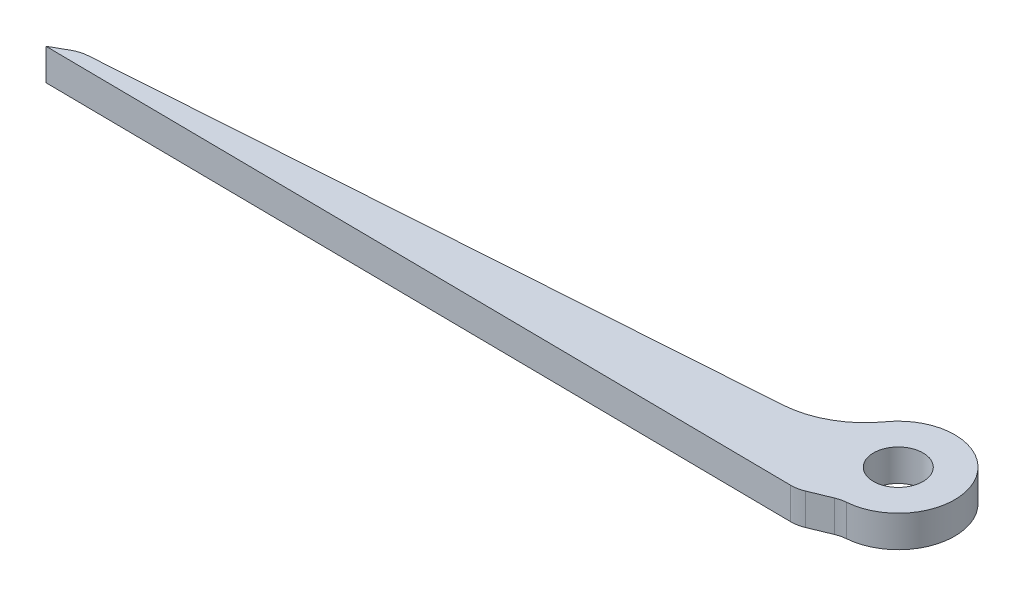
ISO-10303-21;
HEADER;
FILE_DESCRIPTION(('STEP AP214'),'2;1');
FILE_NAME('part.step','',(''),(''),'','','');
FILE_SCHEMA(('AUTOMOTIVE_DESIGN { 1 0 10303 214 1 1 1 1 }'));
ENDSEC;
DATA;
#1=APPLICATION_CONTEXT('core data for automotive mechanical design processes');
#2=APPLICATION_PROTOCOL_DEFINITION('international standard','automotive_design',2000,#1);
#3=PRODUCT_CONTEXT('',#1,'mechanical');
#4=PRODUCT('Part','Part','',(#3));
#5=PRODUCT_RELATED_PRODUCT_CATEGORY('part','',(#4));
#6=PRODUCT_DEFINITION_FORMATION('','',#4);
#7=PRODUCT_DEFINITION_CONTEXT('part definition',#1,'design');
#8=PRODUCT_DEFINITION('design','',#6,#7);
#9=PRODUCT_DEFINITION_SHAPE('','',#8);
#10=(LENGTH_UNIT() NAMED_UNIT(*) SI_UNIT(.MILLI.,.METRE.));
#11=(NAMED_UNIT(*) PLANE_ANGLE_UNIT() SI_UNIT($,.RADIAN.));
#12=(NAMED_UNIT(*) SI_UNIT($,.STERADIAN.) SOLID_ANGLE_UNIT());
#13=UNCERTAINTY_MEASURE_WITH_UNIT(LENGTH_MEASURE(1.E-05),#10,'distance_accuracy_value','');
#14=(GEOMETRIC_REPRESENTATION_CONTEXT(3) GLOBAL_UNCERTAINTY_ASSIGNED_CONTEXT((#13)) GLOBAL_UNIT_ASSIGNED_CONTEXT((#10,
#11,#12)) REPRESENTATION_CONTEXT('',''));
#15=CARTESIAN_POINT('',(0.,0.,0.));
#16=DIRECTION('',(0.,0.,1.));
#17=DIRECTION('',(1.,0.,0.));
#18=AXIS2_PLACEMENT_3D('',#15,#16,#17);
#19=CARTESIAN_POINT('',(0.,3.175,0.));
#20=DIRECTION('',(0.,1.,0.));
#21=DIRECTION('',(0.,0.,1.));
#22=AXIS2_PLACEMENT_3D('',#19,#20,#21);
#23=PLANE('',#22);
#24=CARTESIAN_POINT('',(0.,3.175,0.));
#25=DIRECTION('',(0.,1.,0.));
#26=DIRECTION('',(0.,0.,1.));
#27=AXIS2_PLACEMENT_3D('',#24,#25,#26);
#28=CIRCLE('',#27,5.6642);
#29=CARTESIAN_POINT('',(0.444946616900004,3.175,5.64669674660409));
#30=VERTEX_POINT('',#29);
#31=CARTESIAN_POINT('',(-4.60174845221113,3.175,-3.30258577823082));
#32=VERTEX_POINT('',#31);
#33=EDGE_CURVE('E149',#30,#32,#28,.T.);
#34=ORIENTED_EDGE('',*,*,#33,.T.);
#35=CARTESIAN_POINT('',(-11.8242236014214,3.175,-8.48601637186662));
#36=DIRECTION('',(0.,1.,0.));
#37=DIRECTION('',(0.,0.,1.));
#38=AXIS2_PLACEMENT_3D('',#35,#36,#37);
#39=CIRCLE('',#38,8.89);
#40=CARTESIAN_POINT('',(-11.2121421211736,3.175,0.382887521035677));
#41=VERTEX_POINT('',#40);
#42=EDGE_CURVE('E11',#32,#41,#39,.F.);
#43=ORIENTED_EDGE('',*,*,#42,.T.);
#44=DIRECTION('',(-0.997626984578437,0.,0.0688505602078505));
#45=VECTOR('',#44,1.);
#46=CARTESIAN_POINT('',(-5.6642,3.175,0.));
#47=LINE('',#46,#45);
#48=CARTESIAN_POINT('',(-76.4638174473622,3.175,4.8861883239979));
#49=VERTEX_POINT('',#48);
#50=EDGE_CURVE('E118',#41,#49,#47,.T.);
#51=ORIENTED_EDGE('',*,*,#50,.T.);
#52=CARTESIAN_POINT('',(-76.2452169187023,3.175,8.05365400003444));
#53=DIRECTION('',(0.,1.,0.));
#54=DIRECTION('',(0.,0.,1.));
#55=AXIS2_PLACEMENT_3D('',#52,#53,#54);
#56=CIRCLE('',#55,3.175);
#57=CARTESIAN_POINT('',(-77.8039136184842,3.175,5.28759369734959));
#58=VERTEX_POINT('',#57);
#59=EDGE_CURVE('E114',#49,#58,#56,.T.);
#60=ORIENTED_EDGE('',*,*,#59,.T.);
#61=DIRECTION('',(-0.871200095333811,0.,0.490928094419497));
#62=VECTOR('',#61,1.);
#63=CARTESIAN_POINT('',(-77.1791945502583,3.175,4.93555959708459));
#64=LINE('',#63,#62);
#65=CARTESIAN_POINT('',(-79.3920427924062,3.175,6.18251695691011));
#66=VERTEX_POINT('',#65);
#67=EDGE_CURVE('E107',#58,#66,#64,.T.);
#68=ORIENTED_EDGE('',*,*,#67,.T.);
#69=DIRECTION('',(0.999945461548254,0.,0.0104438464681303));
#70=VECTOR('',#69,1.);
#71=CARTESIAN_POINT('',(-79.3920427924062,3.175,6.18251695691011));
#72=LINE('',#71,#70);
#73=CARTESIAN_POINT('',(-3.83726556900571,3.175,6.97164248784978));
#74=VERTEX_POINT('',#73);
#75=EDGE_CURVE('E111',#66,#74,#72,.T.);
#76=ORIENTED_EDGE('',*,*,#75,.T.);
#77=CARTESIAN_POINT('',(-3.80410635646939,3.175,3.79681564743408));
#78=DIRECTION('',(0.,1.,0.));
#79=DIRECTION('',(0.,0.,1.));
#80=AXIS2_PLACEMENT_3D('',#77,#78,#79);
#81=CIRCLE('',#80,3.175);
#82=CARTESIAN_POINT('',(-2.59537443766945,3.175,6.73272984040263));
#83=VERTEX_POINT('',#82);
#84=EDGE_CURVE('E160',#74,#83,#81,.T.);
#85=ORIENTED_EDGE('',*,*,#84,.T.);
#86=DIRECTION('',(0.924697383612144,0.,-0.380702966551163));
#87=VECTOR('',#86,1.);
#88=CARTESIAN_POINT('',(-3.19204279240622,3.175,6.9783814629996));
#89=LINE('',#88,#87);
#90=CARTESIAN_POINT('',(-0.514375763278859,3.175,5.87597131294276));
#91=VERTEX_POINT('',#90);
#92=EDGE_CURVE('E129',#83,#91,#89,.T.);
#93=ORIENTED_EDGE('',*,*,#92,.T.);
#94=CARTESIAN_POINT('',(0.694356155521082,3.175,8.81188550591132));
#95=DIRECTION('',(0.,1.,0.));
#96=DIRECTION('',(0.,0.,1.));
#97=AXIS2_PLACEMENT_3D('',#94,#95,#96);
#98=CIRCLE('',#97,3.175);
#99=EDGE_CURVE('E174',#91,#30,#98,.F.);
#100=ORIENTED_EDGE('',*,*,#99,.T.);
#101=EDGE_LOOP('',(#34,#43,#51,#60,#68,#76,#85,#93,#100));
#102=FACE_BOUND('',#101,.T.);
#103=CARTESIAN_POINT('',(0.,3.175,0.));
#104=DIRECTION('',(0.,1.,0.));
#105=DIRECTION('',(0.,0.,1.));
#106=AXIS2_PLACEMENT_3D('',#103,#104,#105);
#107=CIRCLE('',#106,2.4892);
#108=CARTESIAN_POINT('',(0.,3.175,2.4892));
#109=VERTEX_POINT('',#108);
#110=EDGE_CURVE('E142',#109,#109,#107,.T.);
#111=ORIENTED_EDGE('',*,*,#110,.F.);
#112=EDGE_LOOP('',(#111));
#113=FACE_BOUND('',#112,.T.);
#114=ADVANCED_FACE('F36',(#102,#113),#23,.T.);
#115=CARTESIAN_POINT('',(0.,0.,0.));
#116=DIRECTION('',(0.,1.,0.));
#117=DIRECTION('',(0.,0.,1.));
#118=AXIS2_PLACEMENT_3D('',#115,#116,#117);
#119=PLANE('',#118);
#120=DIRECTION('',(-0.871200095333811,0.,0.490928094419497));
#121=VECTOR('',#120,1.);
#122=CARTESIAN_POINT('',(-77.1791945502583,0.,4.93555959708459));
#123=LINE('',#122,#121);
#124=CARTESIAN_POINT('',(-77.8039136184842,0.,5.28759369734959));
#125=VERTEX_POINT('',#124);
#126=CARTESIAN_POINT('',(-79.3920427924062,0.,6.18251695691011));
#127=VERTEX_POINT('',#126);
#128=EDGE_CURVE('E124',#125,#127,#123,.T.);
#129=ORIENTED_EDGE('',*,*,#128,.F.);
#130=CARTESIAN_POINT('',(-76.2452169187023,0.,8.05365400003444));
#131=DIRECTION('',(0.,1.,0.));
#132=DIRECTION('',(0.,0.,1.));
#133=AXIS2_PLACEMENT_3D('',#130,#131,#132);
#134=CIRCLE('',#133,3.175);
#135=CARTESIAN_POINT('',(-76.4638174473622,0.,4.8861883239979));
#136=VERTEX_POINT('',#135);
#137=EDGE_CURVE('E154',#125,#136,#134,.F.);
#138=ORIENTED_EDGE('',*,*,#137,.T.);
#139=DIRECTION('',(-0.997626984578437,0.,0.0688505602078505));
#140=VECTOR('',#139,1.);
#141=CARTESIAN_POINT('',(-5.6642,0.,0.));
#142=LINE('',#141,#140);
#143=CARTESIAN_POINT('',(-11.2121421211736,0.,0.382887521035677));
#144=VERTEX_POINT('',#143);
#145=EDGE_CURVE('E141',#144,#136,#142,.T.);
#146=ORIENTED_EDGE('',*,*,#145,.F.);
#147=CARTESIAN_POINT('',(-11.8242236014214,0.,-8.48601637186662));
#148=DIRECTION('',(0.,1.,0.));
#149=DIRECTION('',(0.,0.,1.));
#150=AXIS2_PLACEMENT_3D('',#147,#148,#149);
#151=CIRCLE('',#150,8.89);
#152=CARTESIAN_POINT('',(-4.60174845221113,0.,-3.30258577823082));
#153=VERTEX_POINT('',#152);
#154=EDGE_CURVE('E44',#144,#153,#151,.T.);
#155=ORIENTED_EDGE('',*,*,#154,.T.);
#156=CARTESIAN_POINT('',(0.,0.,0.));
#157=DIRECTION('',(0.,1.,0.));
#158=DIRECTION('',(0.,0.,1.));
#159=AXIS2_PLACEMENT_3D('',#156,#157,#158);
#160=CIRCLE('',#159,5.6642);
#161=CARTESIAN_POINT('',(0.444946616900004,0.,5.64669674660409));
#162=VERTEX_POINT('',#161);
#163=EDGE_CURVE('E139',#162,#153,#160,.T.);
#164=ORIENTED_EDGE('',*,*,#163,.F.);
#165=CARTESIAN_POINT('',(0.694356155521082,0.,8.81188550591132));
#166=DIRECTION('',(0.,1.,0.));
#167=DIRECTION('',(0.,0.,1.));
#168=AXIS2_PLACEMENT_3D('',#165,#166,#167);
#169=CIRCLE('',#168,3.175);
#170=CARTESIAN_POINT('',(-0.514375763278859,0.,5.87597131294276));
#171=VERTEX_POINT('',#170);
#172=EDGE_CURVE('E172',#162,#171,#169,.T.);
#173=ORIENTED_EDGE('',*,*,#172,.T.);
#174=DIRECTION('',(0.924697383612144,0.,-0.380702966551163));
#175=VECTOR('',#174,1.);
#176=CARTESIAN_POINT('',(-3.19204279240622,0.,6.9783814629996));
#177=LINE('',#176,#175);
#178=CARTESIAN_POINT('',(-2.59537443766945,0.,6.73272984040263));
#179=VERTEX_POINT('',#178);
#180=EDGE_CURVE('E147',#179,#171,#177,.T.);
#181=ORIENTED_EDGE('',*,*,#180,.F.);
#182=CARTESIAN_POINT('',(-3.80410635646939,0.,3.79681564743408));
#183=DIRECTION('',(0.,1.,0.));
#184=DIRECTION('',(0.,0.,1.));
#185=AXIS2_PLACEMENT_3D('',#182,#183,#184);
#186=CIRCLE('',#185,3.175);
#187=CARTESIAN_POINT('',(-3.83726556900571,0.,6.97164248784978));
#188=VERTEX_POINT('',#187);
#189=EDGE_CURVE('E152',#179,#188,#186,.F.);
#190=ORIENTED_EDGE('',*,*,#189,.T.);
#191=DIRECTION('',(0.999945461548254,0.,0.0104438464681303));
#192=VECTOR('',#191,1.);
#193=CARTESIAN_POINT('',(-79.3920427924062,0.,6.18251695691011));
#194=LINE('',#193,#192);
#195=EDGE_CURVE('E145',#127,#188,#194,.T.);
#196=ORIENTED_EDGE('',*,*,#195,.F.);
#197=EDGE_LOOP('',(#129,#138,#146,#155,#164,#173,#181,#190,#196));
#198=FACE_BOUND('',#197,.T.);
#199=CARTESIAN_POINT('',(0.,0.,0.));
#200=DIRECTION('',(0.,1.,0.));
#201=DIRECTION('',(0.,0.,1.));
#202=AXIS2_PLACEMENT_3D('',#199,#200,#201);
#203=CIRCLE('',#202,2.4892);
#204=CARTESIAN_POINT('',(0.,0.,2.4892));
#205=VERTEX_POINT('',#204);
#206=EDGE_CURVE('E228',#205,#205,#203,.T.);
#207=ORIENTED_EDGE('',*,*,#206,.T.);
#208=EDGE_LOOP('',(#207));
#209=FACE_BOUND('',#208,.T.);
#210=ADVANCED_FACE('F185',(#198,#209),#119,.F.);
#211=CARTESIAN_POINT('',(0.,3.175,0.));
#212=DIRECTION('',(0.,-1.,0.));
#213=DIRECTION('',(0.,0.,-1.));
#214=AXIS2_PLACEMENT_3D('',#211,#212,#213);
#215=CYLINDRICAL_SURFACE('',#214,5.6642);
#216=ORIENTED_EDGE('',*,*,#163,.T.);
#217=DIRECTION('',(0.,-1.,0.));
#218=VECTOR('',#217,1.);
#219=CARTESIAN_POINT('',(-4.60174845221113,3.175,-3.30258577823082));
#220=LINE('',#219,#218);
#221=EDGE_CURVE('E57',#153,#32,#220,.F.);
#222=ORIENTED_EDGE('',*,*,#221,.T.);
#223=ORIENTED_EDGE('',*,*,#33,.F.);
#224=DIRECTION('',(0.,-1.,0.));
#225=VECTOR('',#224,1.);
#226=CARTESIAN_POINT('',(0.444946616900004,3.175,5.64669674660409));
#227=LINE('',#226,#225);
#228=EDGE_CURVE('E169',#30,#162,#227,.T.);
#229=ORIENTED_EDGE('',*,*,#228,.T.);
#230=EDGE_LOOP('',(#216,#222,#223,#229));
#231=FACE_BOUND('',#230,.T.);
#232=ADVANCED_FACE('F210',(#231),#215,.T.);
#233=CARTESIAN_POINT('',(-5.6642,3.175,0.));
#234=DIRECTION('',(0.0688505602078505,0.,0.997626984578437));
#235=DIRECTION('',(0.997626984578437,0.,-0.0688505602078505));
#236=AXIS2_PLACEMENT_3D('',#233,#234,#235);
#237=PLANE('',#236);
#238=ORIENTED_EDGE('',*,*,#50,.F.);
#239=DIRECTION('',(0.,1.,0.));
#240=VECTOR('',#239,1.);
#241=CARTESIAN_POINT('',(-11.2121421211736,0.,0.382887521035675));
#242=LINE('',#241,#240);
#243=EDGE_CURVE('E176',#41,#144,#242,.F.);
#244=ORIENTED_EDGE('',*,*,#243,.T.);
#245=ORIENTED_EDGE('',*,*,#145,.T.);
#246=DIRECTION('',(0.,-1.,0.));
#247=VECTOR('',#246,1.);
#248=CARTESIAN_POINT('',(-76.4638174473622,3.175,4.8861883239979));
#249=LINE('',#248,#247);
#250=EDGE_CURVE('E157',#136,#49,#249,.F.);
#251=ORIENTED_EDGE('',*,*,#250,.T.);
#252=EDGE_LOOP('',(#238,#244,#245,#251));
#253=FACE_BOUND('',#252,.T.);
#254=ADVANCED_FACE('F182',(#253),#237,.F.);
#255=CARTESIAN_POINT('',(-77.1791945502583,3.175,4.93555959708459));
#256=DIRECTION('',(0.490928094419497,0.,0.871200095333811));
#257=DIRECTION('',(0.871200095333811,0.,-0.490928094419497));
#258=AXIS2_PLACEMENT_3D('',#255,#256,#257);
#259=PLANE('',#258);
#260=ORIENTED_EDGE('',*,*,#67,.F.);
#261=DIRECTION('',(0.,-1.,0.));
#262=VECTOR('',#261,1.);
#263=CARTESIAN_POINT('',(-77.8039136184842,3.175,5.28759369734959));
#264=LINE('',#263,#262);
#265=EDGE_CURVE('E128',#58,#125,#264,.T.);
#266=ORIENTED_EDGE('',*,*,#265,.T.);
#267=ORIENTED_EDGE('',*,*,#128,.T.);
#268=DIRECTION('',(0.,-1.,0.));
#269=VECTOR('',#268,1.);
#270=CARTESIAN_POINT('',(-79.3920427924062,3.175,6.18251695691011));
#271=LINE('',#270,#269);
#272=EDGE_CURVE('E121',#66,#127,#271,.T.);
#273=ORIENTED_EDGE('',*,*,#272,.F.);
#274=EDGE_LOOP('',(#260,#266,#267,#273));
#275=FACE_BOUND('',#274,.T.);
#276=ADVANCED_FACE('F122',(#275),#259,.F.);
#277=CARTESIAN_POINT('',(-79.3920427924062,3.175,6.18251695691011));
#278=DIRECTION('',(0.0104438464681303,0.,-0.999945461548254));
#279=DIRECTION('',(-0.999945461548254,0.,-0.0104438464681303));
#280=AXIS2_PLACEMENT_3D('',#277,#278,#279);
#281=PLANE('',#280);
#282=ORIENTED_EDGE('',*,*,#195,.T.);
#283=DIRECTION('',(0.,-1.,0.));
#284=VECTOR('',#283,1.);
#285=CARTESIAN_POINT('',(-3.83726556900571,3.175,6.97164248784978));
#286=LINE('',#285,#284);
#287=EDGE_CURVE('E133',#188,#74,#286,.F.);
#288=ORIENTED_EDGE('',*,*,#287,.T.);
#289=ORIENTED_EDGE('',*,*,#75,.F.);
#290=ORIENTED_EDGE('',*,*,#272,.T.);
#291=EDGE_LOOP('',(#282,#288,#289,#290));
#292=FACE_BOUND('',#291,.T.);
#293=ADVANCED_FACE('F131',(#292),#281,.F.);
#294=CARTESIAN_POINT('',(-3.19204279240622,3.175,6.9783814629996));
#295=DIRECTION('',(-0.380702966551163,0.,-0.924697383612144));
#296=DIRECTION('',(-0.924697383612144,0.,0.380702966551163));
#297=AXIS2_PLACEMENT_3D('',#294,#295,#296);
#298=PLANE('',#297);
#299=ORIENTED_EDGE('',*,*,#92,.F.);
#300=DIRECTION('',(0.,-1.,0.));
#301=VECTOR('',#300,1.);
#302=CARTESIAN_POINT('',(-2.59537443766945,3.175,6.73272984040263));
#303=LINE('',#302,#301);
#304=EDGE_CURVE('E165',#83,#179,#303,.T.);
#305=ORIENTED_EDGE('',*,*,#304,.T.);
#306=ORIENTED_EDGE('',*,*,#180,.T.);
#307=DIRECTION('',(0.,1.,0.));
#308=VECTOR('',#307,1.);
#309=CARTESIAN_POINT('',(-0.514375763278859,3.175,5.87597131294276));
#310=LINE('',#309,#308);
#311=EDGE_CURVE('E163',#171,#91,#310,.T.);
#312=ORIENTED_EDGE('',*,*,#311,.T.);
#313=EDGE_LOOP('',(#299,#305,#306,#312));
#314=FACE_BOUND('',#313,.T.);
#315=ADVANCED_FACE('F201',(#314),#298,.F.);
#316=CARTESIAN_POINT('',(0.,3.175,0.));
#317=DIRECTION('',(0.,-1.,0.));
#318=DIRECTION('',(0.,0.,-1.));
#319=AXIS2_PLACEMENT_3D('',#316,#317,#318);
#320=CYLINDRICAL_SURFACE('',#319,2.4892);
#321=ORIENTED_EDGE('',*,*,#110,.T.);
#322=EDGE_LOOP('',(#321));
#323=FACE_BOUND('',#322,.T.);
#324=ORIENTED_EDGE('',*,*,#206,.F.);
#325=EDGE_LOOP('',(#324));
#326=FACE_BOUND('',#325,.T.);
#327=ADVANCED_FACE('F192',(#323,#326),#320,.F.);
#328=CARTESIAN_POINT('',(-76.2452169187023,3.175,8.05365400003444));
#329=DIRECTION('',(0.,-1.,0.));
#330=DIRECTION('',(0.,0.,-1.));
#331=AXIS2_PLACEMENT_3D('',#328,#329,#330);
#332=CYLINDRICAL_SURFACE('',#331,3.175);
#333=ORIENTED_EDGE('',*,*,#59,.F.);
#334=ORIENTED_EDGE('',*,*,#250,.F.);
#335=ORIENTED_EDGE('',*,*,#137,.F.);
#336=ORIENTED_EDGE('',*,*,#265,.F.);
#337=EDGE_LOOP('',(#333,#334,#335,#336));
#338=FACE_BOUND('',#337,.T.);
#339=ADVANCED_FACE('F189',(#338),#332,.T.);
#340=CARTESIAN_POINT('',(-3.80410635646939,3.175,3.79681564743408));
#341=DIRECTION('',(0.,-1.,0.));
#342=DIRECTION('',(0.,0.,-1.));
#343=AXIS2_PLACEMENT_3D('',#340,#341,#342);
#344=CYLINDRICAL_SURFACE('',#343,3.175);
#345=ORIENTED_EDGE('',*,*,#84,.F.);
#346=ORIENTED_EDGE('',*,*,#287,.F.);
#347=ORIENTED_EDGE('',*,*,#189,.F.);
#348=ORIENTED_EDGE('',*,*,#304,.F.);
#349=EDGE_LOOP('',(#345,#346,#347,#348));
#350=FACE_BOUND('',#349,.T.);
#351=ADVANCED_FACE('F191',(#350),#344,.T.);
#352=CARTESIAN_POINT('',(0.694356155521082,3.175,8.81188550591132));
#353=DIRECTION('',(0.,-1.,0.));
#354=DIRECTION('',(0.,0.,-1.));
#355=AXIS2_PLACEMENT_3D('',#352,#353,#354);
#356=CYLINDRICAL_SURFACE('',#355,3.175);
#357=ORIENTED_EDGE('',*,*,#99,.F.);
#358=ORIENTED_EDGE('',*,*,#311,.F.);
#359=ORIENTED_EDGE('',*,*,#172,.F.);
#360=ORIENTED_EDGE('',*,*,#228,.F.);
#361=EDGE_LOOP('',(#357,#358,#359,#360));
#362=FACE_BOUND('',#361,.T.);
#363=ADVANCED_FACE('F198',(#362),#356,.F.);
#364=CARTESIAN_POINT('',(-11.8242236014214,3.175,-8.48601637186662));
#365=DIRECTION('',(0.,-1.,0.));
#366=DIRECTION('',(0.,0.,-1.));
#367=AXIS2_PLACEMENT_3D('',#364,#365,#366);
#368=CYLINDRICAL_SURFACE('',#367,8.89);
#369=ORIENTED_EDGE('',*,*,#42,.F.);
#370=ORIENTED_EDGE('',*,*,#221,.F.);
#371=ORIENTED_EDGE('',*,*,#154,.F.);
#372=ORIENTED_EDGE('',*,*,#243,.F.);
#373=EDGE_LOOP('',(#369,#370,#371,#372));
#374=FACE_BOUND('',#373,.T.);
#375=ADVANCED_FACE('F38',(#374),#368,.F.);
#376=CLOSED_SHELL('',(#114,#210,#232,#254,#276,#293,#315,#327,#339,#351,#363,#375));
#377=MANIFOLD_SOLID_BREP('B2',#376);
#378=ADVANCED_BREP_SHAPE_REPRESENTATION('',(#18,#377),#14);
#379=SHAPE_DEFINITION_REPRESENTATION(#9,#378);
ENDSEC;
END-ISO-10303-21;
